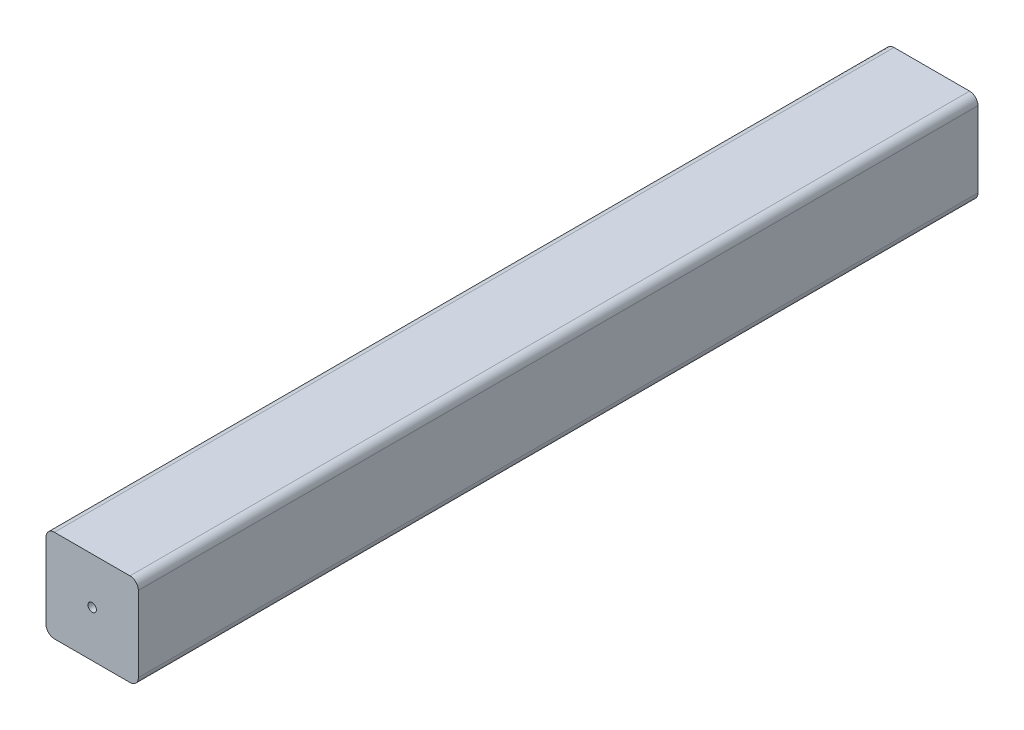
ISO-10303-21;
HEADER;
FILE_DESCRIPTION(('STEP AP214'),'2;1');
FILE_NAME('part.step','',(''),(''),'','','');
FILE_SCHEMA(('AUTOMOTIVE_DESIGN { 1 0 10303 214 1 1 1 1 }'));
ENDSEC;
DATA;
#1=APPLICATION_CONTEXT('core data for automotive mechanical design processes');
#2=APPLICATION_PROTOCOL_DEFINITION('international standard','automotive_design',2000,#1);
#3=PRODUCT_CONTEXT('',#1,'mechanical');
#4=PRODUCT('Part','Part','',(#3));
#5=PRODUCT_RELATED_PRODUCT_CATEGORY('part','',(#4));
#6=PRODUCT_DEFINITION_FORMATION('','',#4);
#7=PRODUCT_DEFINITION_CONTEXT('part definition',#1,'design');
#8=PRODUCT_DEFINITION('design','',#6,#7);
#9=PRODUCT_DEFINITION_SHAPE('','',#8);
#10=(LENGTH_UNIT() NAMED_UNIT(*) SI_UNIT(.MILLI.,.METRE.));
#11=(NAMED_UNIT(*) PLANE_ANGLE_UNIT() SI_UNIT($,.RADIAN.));
#12=(NAMED_UNIT(*) SI_UNIT($,.STERADIAN.) SOLID_ANGLE_UNIT());
#13=UNCERTAINTY_MEASURE_WITH_UNIT(LENGTH_MEASURE(1.E-05),#10,'distance_accuracy_value','');
#14=(GEOMETRIC_REPRESENTATION_CONTEXT(3) GLOBAL_UNCERTAINTY_ASSIGNED_CONTEXT((#13)) GLOBAL_UNIT_ASSIGNED_CONTEXT((#10,
#11,#12)) REPRESENTATION_CONTEXT('',''));
#15=CARTESIAN_POINT('',(0.,0.,0.));
#16=DIRECTION('',(0.,0.,1.));
#17=DIRECTION('',(1.,0.,0.));
#18=AXIS2_PLACEMENT_3D('',#15,#16,#17);
#19=CARTESIAN_POINT('',(-9.,9.,200.));
#20=DIRECTION('',(0.,0.,-1.));
#21=DIRECTION('',(-1.,0.,0.));
#22=AXIS2_PLACEMENT_3D('',#19,#20,#21);
#23=PLANE('',#22);
#24=CARTESIAN_POINT('',(-9.,9.,200.));
#25=DIRECTION('',(0.,0.,1.));
#26=DIRECTION('',(-1.,0.,0.));
#27=AXIS2_PLACEMENT_3D('',#24,#25,#26);
#28=CIRCLE('',#27,2.);
#29=CARTESIAN_POINT('',(-8.99999999999998,11.,200.));
#30=VERTEX_POINT('',#29);
#31=CARTESIAN_POINT('',(-11.,8.99999999999999,200.));
#32=VERTEX_POINT('',#31);
#33=EDGE_CURVE('E142',#30,#32,#28,.T.);
#34=ORIENTED_EDGE('',*,*,#33,.T.);
#35=DIRECTION('',(0.,-1.,0.));
#36=VECTOR('',#35,1.);
#37=CARTESIAN_POINT('',(-11.,-8.99999999999999,200.));
#38=LINE('',#37,#36);
#39=CARTESIAN_POINT('',(-11.,-8.99999999999999,200.));
#40=VERTEX_POINT('',#39);
#41=EDGE_CURVE('E90',#32,#40,#38,.T.);
#42=ORIENTED_EDGE('',*,*,#41,.T.);
#43=CARTESIAN_POINT('',(-9.,-9.,200.));
#44=DIRECTION('',(0.,0.,1.));
#45=DIRECTION('',(-1.,0.,0.));
#46=AXIS2_PLACEMENT_3D('',#43,#44,#45);
#47=CIRCLE('',#46,2.);
#48=CARTESIAN_POINT('',(-8.99999999999998,-11.,200.));
#49=VERTEX_POINT('',#48);
#50=EDGE_CURVE('E157',#40,#49,#47,.T.);
#51=ORIENTED_EDGE('',*,*,#50,.T.);
#52=DIRECTION('',(1.,0.,0.));
#53=VECTOR('',#52,1.);
#54=CARTESIAN_POINT('',(8.99999999999999,-11.,200.));
#55=LINE('',#54,#53);
#56=CARTESIAN_POINT('',(8.99999999999999,-11.,200.));
#57=VERTEX_POINT('',#56);
#58=EDGE_CURVE('E170',#49,#57,#55,.T.);
#59=ORIENTED_EDGE('',*,*,#58,.T.);
#60=CARTESIAN_POINT('',(9.,-9.,200.));
#61=DIRECTION('',(0.,0.,1.));
#62=DIRECTION('',(-1.,0.,0.));
#63=AXIS2_PLACEMENT_3D('',#60,#61,#62);
#64=CIRCLE('',#63,2.);
#65=CARTESIAN_POINT('',(11.,-8.99999999999999,200.));
#66=VERTEX_POINT('',#65);
#67=EDGE_CURVE('E109',#57,#66,#64,.T.);
#68=ORIENTED_EDGE('',*,*,#67,.T.);
#69=DIRECTION('',(0.,1.,0.));
#70=VECTOR('',#69,1.);
#71=CARTESIAN_POINT('',(11.,8.99999999999999,200.));
#72=LINE('',#71,#70);
#73=CARTESIAN_POINT('',(11.,8.99999999999999,200.));
#74=VERTEX_POINT('',#73);
#75=EDGE_CURVE('E103',#66,#74,#72,.T.);
#76=ORIENTED_EDGE('',*,*,#75,.T.);
#77=CARTESIAN_POINT('',(9.,9.,200.));
#78=DIRECTION('',(0.,0.,1.));
#79=DIRECTION('',(-1.,0.,0.));
#80=AXIS2_PLACEMENT_3D('',#77,#78,#79);
#81=CIRCLE('',#80,2.);
#82=CARTESIAN_POINT('',(8.99999999999999,11.,200.));
#83=VERTEX_POINT('',#82);
#84=EDGE_CURVE('E107',#74,#83,#81,.T.);
#85=ORIENTED_EDGE('',*,*,#84,.T.);
#86=DIRECTION('',(-1.,0.,0.));
#87=VECTOR('',#86,1.);
#88=CARTESIAN_POINT('',(-8.99999999999998,11.,200.));
#89=LINE('',#88,#87);
#90=EDGE_CURVE('E47',#83,#30,#89,.T.);
#91=ORIENTED_EDGE('',*,*,#90,.T.);
#92=EDGE_LOOP('',(#34,#42,#51,#59,#68,#76,#85,#91));
#93=FACE_BOUND('',#92,.T.);
#94=CARTESIAN_POINT('',(0.,0.,200.));
#95=DIRECTION('',(0.,0.,1.));
#96=DIRECTION('',(1.,0.,0.));
#97=AXIS2_PLACEMENT_3D('',#94,#95,#96);
#98=CIRCLE('',#97,1.);
#99=CARTESIAN_POINT('',(1.,0.,200.));
#100=VERTEX_POINT('',#99);
#101=EDGE_CURVE('E131',#100,#100,#98,.T.);
#102=ORIENTED_EDGE('',*,*,#101,.F.);
#103=EDGE_LOOP('',(#102));
#104=FACE_BOUND('',#103,.T.);
#105=ADVANCED_FACE('F30',(#93,#104),#23,.F.);
#106=CARTESIAN_POINT('',(-9.,9.,0.));
#107=DIRECTION('',(0.,0.,-1.));
#108=DIRECTION('',(-1.,0.,0.));
#109=AXIS2_PLACEMENT_3D('',#106,#107,#108);
#110=PLANE('',#109);
#111=CARTESIAN_POINT('',(-9.,9.,0.));
#112=DIRECTION('',(0.,0.,1.));
#113=DIRECTION('',(-1.,0.,0.));
#114=AXIS2_PLACEMENT_3D('',#111,#112,#113);
#115=CIRCLE('',#114,2.);
#116=CARTESIAN_POINT('',(-8.99999999999998,11.,0.));
#117=VERTEX_POINT('',#116);
#118=CARTESIAN_POINT('',(-11.,8.99999999999999,0.));
#119=VERTEX_POINT('',#118);
#120=EDGE_CURVE('E127',#117,#119,#115,.T.);
#121=ORIENTED_EDGE('',*,*,#120,.F.);
#122=DIRECTION('',(-1.,0.,0.));
#123=VECTOR('',#122,1.);
#124=CARTESIAN_POINT('',(-8.99999999999998,11.,0.));
#125=LINE('',#124,#123);
#126=CARTESIAN_POINT('',(8.99999999999999,11.,0.));
#127=VERTEX_POINT('',#126);
#128=EDGE_CURVE('E82',#127,#117,#125,.T.);
#129=ORIENTED_EDGE('',*,*,#128,.F.);
#130=CARTESIAN_POINT('',(9.,9.,0.));
#131=DIRECTION('',(0.,0.,1.));
#132=DIRECTION('',(-1.,0.,0.));
#133=AXIS2_PLACEMENT_3D('',#130,#131,#132);
#134=CIRCLE('',#133,2.);
#135=CARTESIAN_POINT('',(11.,8.99999999999999,0.));
#136=VERTEX_POINT('',#135);
#137=EDGE_CURVE('E76',#136,#127,#134,.T.);
#138=ORIENTED_EDGE('',*,*,#137,.F.);
#139=DIRECTION('',(0.,1.,0.));
#140=VECTOR('',#139,1.);
#141=CARTESIAN_POINT('',(11.,8.99999999999999,0.));
#142=LINE('',#141,#140);
#143=CARTESIAN_POINT('',(11.,-8.99999999999999,0.));
#144=VERTEX_POINT('',#143);
#145=EDGE_CURVE('E117',#144,#136,#142,.T.);
#146=ORIENTED_EDGE('',*,*,#145,.F.);
#147=CARTESIAN_POINT('',(9.,-9.,0.));
#148=DIRECTION('',(0.,0.,1.));
#149=DIRECTION('',(-1.,0.,0.));
#150=AXIS2_PLACEMENT_3D('',#147,#148,#149);
#151=CIRCLE('',#150,2.);
#152=CARTESIAN_POINT('',(8.99999999999999,-11.,0.));
#153=VERTEX_POINT('',#152);
#154=EDGE_CURVE('E137',#153,#144,#151,.T.);
#155=ORIENTED_EDGE('',*,*,#154,.F.);
#156=DIRECTION('',(1.,0.,0.));
#157=VECTOR('',#156,1.);
#158=CARTESIAN_POINT('',(8.99999999999999,-11.,0.));
#159=LINE('',#158,#157);
#160=CARTESIAN_POINT('',(-8.99999999999998,-11.,0.));
#161=VERTEX_POINT('',#160);
#162=EDGE_CURVE('E135',#161,#153,#159,.T.);
#163=ORIENTED_EDGE('',*,*,#162,.F.);
#164=CARTESIAN_POINT('',(-9.,-9.,0.));
#165=DIRECTION('',(0.,0.,1.));
#166=DIRECTION('',(-1.,0.,0.));
#167=AXIS2_PLACEMENT_3D('',#164,#165,#166);
#168=CIRCLE('',#167,2.);
#169=CARTESIAN_POINT('',(-11.,-8.99999999999999,0.));
#170=VERTEX_POINT('',#169);
#171=EDGE_CURVE('E133',#170,#161,#168,.T.);
#172=ORIENTED_EDGE('',*,*,#171,.F.);
#173=DIRECTION('',(0.,-1.,0.));
#174=VECTOR('',#173,1.);
#175=CARTESIAN_POINT('',(-11.,-8.99999999999999,0.));
#176=LINE('',#175,#174);
#177=EDGE_CURVE('E130',#119,#170,#176,.T.);
#178=ORIENTED_EDGE('',*,*,#177,.F.);
#179=EDGE_LOOP('',(#121,#129,#138,#146,#155,#163,#172,#178));
#180=FACE_BOUND('',#179,.T.);
#181=CARTESIAN_POINT('',(0.,0.,0.));
#182=DIRECTION('',(0.,0.,1.));
#183=DIRECTION('',(1.,0.,0.));
#184=AXIS2_PLACEMENT_3D('',#181,#182,#183);
#185=CIRCLE('',#184,1.);
#186=CARTESIAN_POINT('',(1.,0.,0.));
#187=VERTEX_POINT('',#186);
#188=EDGE_CURVE('E176',#187,#187,#185,.T.);
#189=ORIENTED_EDGE('',*,*,#188,.T.);
#190=EDGE_LOOP('',(#189));
#191=FACE_BOUND('',#190,.T.);
#192=ADVANCED_FACE('F161',(#180,#191),#110,.T.);
#193=CARTESIAN_POINT('',(-9.,9.,200.));
#194=DIRECTION('',(0.,0.,-1.));
#195=DIRECTION('',(-1.,0.,0.));
#196=AXIS2_PLACEMENT_3D('',#193,#194,#195);
#197=CYLINDRICAL_SURFACE('',#196,2.);
#198=ORIENTED_EDGE('',*,*,#120,.T.);
#199=DIRECTION('',(0.,0.,-1.));
#200=VECTOR('',#199,1.);
#201=CARTESIAN_POINT('',(-11.,8.99999999999999,200.));
#202=LINE('',#201,#200);
#203=EDGE_CURVE('E11',#32,#119,#202,.T.);
#204=ORIENTED_EDGE('',*,*,#203,.F.);
#205=ORIENTED_EDGE('',*,*,#33,.F.);
#206=DIRECTION('',(0.,0.,-1.));
#207=VECTOR('',#206,1.);
#208=CARTESIAN_POINT('',(-8.99999999999998,11.,200.));
#209=LINE('',#208,#207);
#210=EDGE_CURVE('E123',#30,#117,#209,.T.);
#211=ORIENTED_EDGE('',*,*,#210,.T.);
#212=EDGE_LOOP('',(#198,#204,#205,#211));
#213=FACE_BOUND('',#212,.T.);
#214=ADVANCED_FACE('F32',(#213),#197,.T.);
#215=CARTESIAN_POINT('',(-11.,-8.99999999999999,200.));
#216=DIRECTION('',(1.,0.,0.));
#217=DIRECTION('',(0.,0.,-1.));
#218=AXIS2_PLACEMENT_3D('',#215,#216,#217);
#219=PLANE('',#218);
#220=ORIENTED_EDGE('',*,*,#177,.T.);
#221=DIRECTION('',(0.,0.,-1.));
#222=VECTOR('',#221,1.);
#223=CARTESIAN_POINT('',(-11.,-8.99999999999999,200.));
#224=LINE('',#223,#222);
#225=EDGE_CURVE('E39',#40,#170,#224,.T.);
#226=ORIENTED_EDGE('',*,*,#225,.F.);
#227=ORIENTED_EDGE('',*,*,#41,.F.);
#228=ORIENTED_EDGE('',*,*,#203,.T.);
#229=EDGE_LOOP('',(#220,#226,#227,#228));
#230=FACE_BOUND('',#229,.T.);
#231=ADVANCED_FACE('F204',(#230),#219,.F.);
#232=CARTESIAN_POINT('',(-9.,-9.,200.));
#233=DIRECTION('',(0.,0.,-1.));
#234=DIRECTION('',(-1.,0.,0.));
#235=AXIS2_PLACEMENT_3D('',#232,#233,#234);
#236=CYLINDRICAL_SURFACE('',#235,2.);
#237=ORIENTED_EDGE('',*,*,#171,.T.);
#238=DIRECTION('',(0.,0.,-1.));
#239=VECTOR('',#238,1.);
#240=CARTESIAN_POINT('',(-8.99999999999998,-11.,200.));
#241=LINE('',#240,#239);
#242=EDGE_CURVE('E149',#49,#161,#241,.T.);
#243=ORIENTED_EDGE('',*,*,#242,.F.);
#244=ORIENTED_EDGE('',*,*,#50,.F.);
#245=ORIENTED_EDGE('',*,*,#225,.T.);
#246=EDGE_LOOP('',(#237,#243,#244,#245));
#247=FACE_BOUND('',#246,.T.);
#248=ADVANCED_FACE('F155',(#247),#236,.T.);
#249=CARTESIAN_POINT('',(8.99999999999999,-11.,200.));
#250=DIRECTION('',(0.,1.,0.));
#251=DIRECTION('',(-1.,0.,0.));
#252=AXIS2_PLACEMENT_3D('',#249,#250,#251);
#253=PLANE('',#252);
#254=ORIENTED_EDGE('',*,*,#162,.T.);
#255=DIRECTION('',(0.,0.,-1.));
#256=VECTOR('',#255,1.);
#257=CARTESIAN_POINT('',(8.99999999999999,-11.,200.));
#258=LINE('',#257,#256);
#259=EDGE_CURVE('E146',#57,#153,#258,.T.);
#260=ORIENTED_EDGE('',*,*,#259,.F.);
#261=ORIENTED_EDGE('',*,*,#58,.F.);
#262=ORIENTED_EDGE('',*,*,#242,.T.);
#263=EDGE_LOOP('',(#254,#260,#261,#262));
#264=FACE_BOUND('',#263,.T.);
#265=ADVANCED_FACE('F166',(#264),#253,.F.);
#266=CARTESIAN_POINT('',(9.,-9.,200.));
#267=DIRECTION('',(0.,0.,-1.));
#268=DIRECTION('',(-1.,0.,0.));
#269=AXIS2_PLACEMENT_3D('',#266,#267,#268);
#270=CYLINDRICAL_SURFACE('',#269,2.);
#271=ORIENTED_EDGE('',*,*,#154,.T.);
#272=DIRECTION('',(0.,0.,-1.));
#273=VECTOR('',#272,1.);
#274=CARTESIAN_POINT('',(11.,-8.99999999999999,200.));
#275=LINE('',#274,#273);
#276=EDGE_CURVE('E118',#66,#144,#275,.T.);
#277=ORIENTED_EDGE('',*,*,#276,.F.);
#278=ORIENTED_EDGE('',*,*,#67,.F.);
#279=ORIENTED_EDGE('',*,*,#259,.T.);
#280=EDGE_LOOP('',(#271,#277,#278,#279));
#281=FACE_BOUND('',#280,.T.);
#282=ADVANCED_FACE('F169',(#281),#270,.T.);
#283=CARTESIAN_POINT('',(11.,8.99999999999999,200.));
#284=DIRECTION('',(-1.,0.,0.));
#285=DIRECTION('',(0.,-1.,0.));
#286=AXIS2_PLACEMENT_3D('',#283,#284,#285);
#287=PLANE('',#286);
#288=ORIENTED_EDGE('',*,*,#145,.T.);
#289=DIRECTION('',(0.,0.,-1.));
#290=VECTOR('',#289,1.);
#291=CARTESIAN_POINT('',(11.,8.99999999999999,200.));
#292=LINE('',#291,#290);
#293=EDGE_CURVE('E114',#74,#136,#292,.T.);
#294=ORIENTED_EDGE('',*,*,#293,.F.);
#295=ORIENTED_EDGE('',*,*,#75,.F.);
#296=ORIENTED_EDGE('',*,*,#276,.T.);
#297=EDGE_LOOP('',(#288,#294,#295,#296));
#298=FACE_BOUND('',#297,.T.);
#299=ADVANCED_FACE('F115',(#298),#287,.F.);
#300=CARTESIAN_POINT('',(9.,9.,200.));
#301=DIRECTION('',(0.,0.,-1.));
#302=DIRECTION('',(-1.,0.,0.));
#303=AXIS2_PLACEMENT_3D('',#300,#301,#302);
#304=CYLINDRICAL_SURFACE('',#303,2.);
#305=ORIENTED_EDGE('',*,*,#137,.T.);
#306=DIRECTION('',(0.,0.,-1.));
#307=VECTOR('',#306,1.);
#308=CARTESIAN_POINT('',(8.99999999999999,11.,200.));
#309=LINE('',#308,#307);
#310=EDGE_CURVE('E119',#83,#127,#309,.T.);
#311=ORIENTED_EDGE('',*,*,#310,.F.);
#312=ORIENTED_EDGE('',*,*,#84,.F.);
#313=ORIENTED_EDGE('',*,*,#293,.T.);
#314=EDGE_LOOP('',(#305,#311,#312,#313));
#315=FACE_BOUND('',#314,.T.);
#316=ADVANCED_FACE('F121',(#315),#304,.T.);
#317=CARTESIAN_POINT('',(-8.99999999999998,11.,200.));
#318=DIRECTION('',(0.,-1.,0.));
#319=DIRECTION('',(0.,0.,-1.));
#320=AXIS2_PLACEMENT_3D('',#317,#318,#319);
#321=PLANE('',#320);
#322=ORIENTED_EDGE('',*,*,#128,.T.);
#323=ORIENTED_EDGE('',*,*,#210,.F.);
#324=ORIENTED_EDGE('',*,*,#90,.F.);
#325=ORIENTED_EDGE('',*,*,#310,.T.);
#326=EDGE_LOOP('',(#322,#323,#324,#325));
#327=FACE_BOUND('',#326,.T.);
#328=ADVANCED_FACE('F192',(#327),#321,.F.);
#329=CARTESIAN_POINT('',(0.,0.,200.));
#330=DIRECTION('',(0.,0.,-1.));
#331=DIRECTION('',(-1.,0.,0.));
#332=AXIS2_PLACEMENT_3D('',#329,#330,#331);
#333=CYLINDRICAL_SURFACE('',#332,1.);
#334=ORIENTED_EDGE('',*,*,#101,.T.);
#335=EDGE_LOOP('',(#334));
#336=FACE_BOUND('',#335,.T.);
#337=ORIENTED_EDGE('',*,*,#188,.F.);
#338=EDGE_LOOP('',(#337));
#339=FACE_BOUND('',#338,.T.);
#340=ADVANCED_FACE('F182',(#336,#339),#333,.F.);
#341=CLOSED_SHELL('',(#105,#192,#214,#231,#248,#265,#282,#299,#316,#328,#340));
#342=MANIFOLD_SOLID_BREP('B2',#341);
#343=ADVANCED_BREP_SHAPE_REPRESENTATION('',(#18,#342),#14);
#344=SHAPE_DEFINITION_REPRESENTATION(#9,#343);
ENDSEC;
END-ISO-10303-21;
